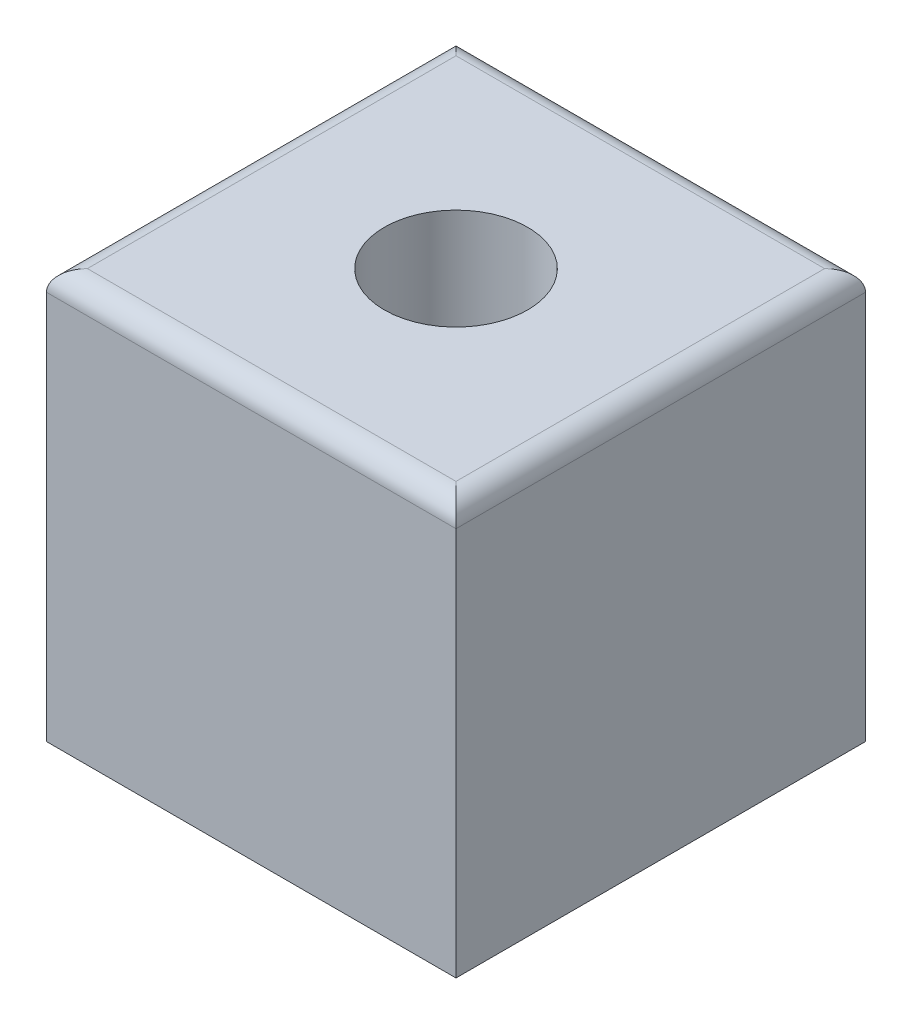
ISO-10303-21;
HEADER;
FILE_DESCRIPTION(('STEP AP214'),'2;1');
FILE_NAME('part.step','',(''),(''),'','','');
FILE_SCHEMA(('AUTOMOTIVE_DESIGN { 1 0 10303 214 1 1 1 1 }'));
ENDSEC;
DATA;
#1=APPLICATION_CONTEXT('core data for automotive mechanical design processes');
#2=APPLICATION_PROTOCOL_DEFINITION('international standard','automotive_design',2000,#1);
#3=PRODUCT_CONTEXT('',#1,'mechanical');
#4=PRODUCT('Part','Part','',(#3));
#5=PRODUCT_RELATED_PRODUCT_CATEGORY('part','',(#4));
#6=PRODUCT_DEFINITION_FORMATION('','',#4);
#7=PRODUCT_DEFINITION_CONTEXT('part definition',#1,'design');
#8=PRODUCT_DEFINITION('design','',#6,#7);
#9=PRODUCT_DEFINITION_SHAPE('','',#8);
#10=(LENGTH_UNIT() NAMED_UNIT(*) SI_UNIT(.MILLI.,.METRE.));
#11=(NAMED_UNIT(*) PLANE_ANGLE_UNIT() SI_UNIT($,.RADIAN.));
#12=(NAMED_UNIT(*) SI_UNIT($,.STERADIAN.) SOLID_ANGLE_UNIT());
#13=UNCERTAINTY_MEASURE_WITH_UNIT(LENGTH_MEASURE(1.E-05),#10,'distance_accuracy_value','');
#14=(GEOMETRIC_REPRESENTATION_CONTEXT(3) GLOBAL_UNCERTAINTY_ASSIGNED_CONTEXT((#13)) GLOBAL_UNIT_ASSIGNED_CONTEXT((#10,
#11,#12)) REPRESENTATION_CONTEXT('',''));
#15=CARTESIAN_POINT('',(0.,0.,0.));
#16=DIRECTION('',(0.,0.,1.));
#17=DIRECTION('',(1.,0.,0.));
#18=AXIS2_PLACEMENT_3D('',#15,#16,#17);
#19=CARTESIAN_POINT('',(-127.,127.,127.));
#20=DIRECTION('',(1.,0.,0.));
#21=DIRECTION('',(0.,1.,0.));
#22=AXIS2_PLACEMENT_3D('',#19,#20,#21);
#23=PLANE('',#22);
#24=DIRECTION('',(0.,-1.,0.));
#25=VECTOR('',#24,1.);
#26=CARTESIAN_POINT('',(-127.,127.,127.));
#27=LINE('',#26,#25);
#28=CARTESIAN_POINT('',(-127.,114.3,127.));
#29=VERTEX_POINT('',#28);
#30=CARTESIAN_POINT('',(-127.,-127.,127.));
#31=VERTEX_POINT('',#30);
#32=EDGE_CURVE('E85',#29,#31,#27,.T.);
#33=ORIENTED_EDGE('',*,*,#32,.F.);
#34=DIRECTION('',(0.,0.,-1.));
#35=VECTOR('',#34,1.);
#36=CARTESIAN_POINT('',(-127.,114.3,-127.));
#37=LINE('',#36,#35);
#38=CARTESIAN_POINT('',(-127.,114.3,-127.));
#39=VERTEX_POINT('',#38);
#40=EDGE_CURVE('E55',#29,#39,#37,.T.);
#41=ORIENTED_EDGE('',*,*,#40,.T.);
#42=DIRECTION('',(0.,-1.,0.));
#43=VECTOR('',#42,1.);
#44=CARTESIAN_POINT('',(-127.,127.,-127.));
#45=LINE('',#44,#43);
#46=CARTESIAN_POINT('',(-127.,-127.,-127.));
#47=VERTEX_POINT('',#46);
#48=EDGE_CURVE('E102',#39,#47,#45,.T.);
#49=ORIENTED_EDGE('',*,*,#48,.T.);
#50=DIRECTION('',(0.,0.,-1.));
#51=VECTOR('',#50,1.);
#52=CARTESIAN_POINT('',(-127.,-127.,127.));
#53=LINE('',#52,#51);
#54=EDGE_CURVE('E97',#31,#47,#53,.T.);
#55=ORIENTED_EDGE('',*,*,#54,.F.);
#56=EDGE_LOOP('',(#33,#41,#49,#55));
#57=FACE_BOUND('',#56,.T.);
#58=ADVANCED_FACE('F33',(#57),#23,.F.);
#59=CARTESIAN_POINT('',(-127.,-127.,127.));
#60=DIRECTION('',(0.,1.,0.));
#61=DIRECTION('',(0.,0.,1.));
#62=AXIS2_PLACEMENT_3D('',#59,#60,#61);
#63=PLANE('',#62);
#64=DIRECTION('',(1.,0.,0.));
#65=VECTOR('',#64,1.);
#66=CARTESIAN_POINT('',(-127.,-127.,-127.));
#67=LINE('',#66,#65);
#68=CARTESIAN_POINT('',(127.,-127.,-127.));
#69=VERTEX_POINT('',#68);
#70=EDGE_CURVE('E146',#47,#69,#67,.T.);
#71=ORIENTED_EDGE('',*,*,#70,.T.);
#72=DIRECTION('',(0.,0.,-1.));
#73=VECTOR('',#72,1.);
#74=CARTESIAN_POINT('',(127.,-127.,127.));
#75=LINE('',#74,#73);
#76=CARTESIAN_POINT('',(127.,-127.,127.));
#77=VERTEX_POINT('',#76);
#78=EDGE_CURVE('E99',#77,#69,#75,.T.);
#79=ORIENTED_EDGE('',*,*,#78,.F.);
#80=DIRECTION('',(1.,0.,0.));
#81=VECTOR('',#80,1.);
#82=CARTESIAN_POINT('',(-127.,-127.,127.));
#83=LINE('',#82,#81);
#84=EDGE_CURVE('E88',#31,#77,#83,.T.);
#85=ORIENTED_EDGE('',*,*,#84,.F.);
#86=ORIENTED_EDGE('',*,*,#54,.T.);
#87=EDGE_LOOP('',(#71,#79,#85,#86));
#88=FACE_BOUND('',#87,.T.);
#89=ADVANCED_FACE('F96',(#88),#63,.F.);
#90=CARTESIAN_POINT('',(127.,127.,127.));
#91=DIRECTION('',(1.,0.,0.));
#92=DIRECTION('',(0.,0.,-1.));
#93=AXIS2_PLACEMENT_3D('',#90,#91,#92);
#94=PLANE('',#93);
#95=DIRECTION('',(0.,-1.,0.));
#96=VECTOR('',#95,1.);
#97=CARTESIAN_POINT('',(127.,127.,-127.));
#98=LINE('',#97,#96);
#99=CARTESIAN_POINT('',(127.,114.3,-127.));
#100=VERTEX_POINT('',#99);
#101=EDGE_CURVE('E91',#100,#69,#98,.T.);
#102=ORIENTED_EDGE('',*,*,#101,.F.);
#103=DIRECTION('',(0.,0.,-1.));
#104=VECTOR('',#103,1.);
#105=CARTESIAN_POINT('',(127.,114.3,127.));
#106=LINE('',#105,#104);
#107=CARTESIAN_POINT('',(127.,114.3,127.));
#108=VERTEX_POINT('',#107);
#109=EDGE_CURVE('E117',#100,#108,#106,.F.);
#110=ORIENTED_EDGE('',*,*,#109,.T.);
#111=DIRECTION('',(0.,-1.,0.));
#112=VECTOR('',#111,1.);
#113=CARTESIAN_POINT('',(127.,127.,127.));
#114=LINE('',#113,#112);
#115=EDGE_CURVE('E100',#108,#77,#114,.T.);
#116=ORIENTED_EDGE('',*,*,#115,.T.);
#117=ORIENTED_EDGE('',*,*,#78,.T.);
#118=EDGE_LOOP('',(#102,#110,#116,#117));
#119=FACE_BOUND('',#118,.T.);
#120=ADVANCED_FACE('F152',(#119),#94,.T.);
#121=CARTESIAN_POINT('',(-127.,127.,127.));
#122=DIRECTION('',(0.,1.,0.));
#123=DIRECTION('',(0.,0.,1.));
#124=AXIS2_PLACEMENT_3D('',#121,#122,#123);
#125=PLANE('',#124);
#126=DIRECTION('',(0.,0.,-1.));
#127=VECTOR('',#126,1.);
#128=CARTESIAN_POINT('',(114.3,127.,127.));
#129=LINE('',#128,#127);
#130=CARTESIAN_POINT('',(114.3,127.,114.3));
#131=VERTEX_POINT('',#130);
#132=CARTESIAN_POINT('',(114.3,127.,-114.3));
#133=VERTEX_POINT('',#132);
#134=EDGE_CURVE('E112',#131,#133,#129,.T.);
#135=ORIENTED_EDGE('',*,*,#134,.T.);
#136=DIRECTION('',(1.,0.,0.));
#137=VECTOR('',#136,1.);
#138=CARTESIAN_POINT('',(-127.,127.,-114.3));
#139=LINE('',#138,#137);
#140=CARTESIAN_POINT('',(-114.3,127.,-114.3));
#141=VERTEX_POINT('',#140);
#142=EDGE_CURVE('E115',#133,#141,#139,.F.);
#143=ORIENTED_EDGE('',*,*,#142,.T.);
#144=DIRECTION('',(0.,0.,-1.));
#145=VECTOR('',#144,1.);
#146=CARTESIAN_POINT('',(-114.3,127.,127.));
#147=LINE('',#146,#145);
#148=CARTESIAN_POINT('',(-114.3,127.,114.3));
#149=VERTEX_POINT('',#148);
#150=EDGE_CURVE('E106',#141,#149,#147,.F.);
#151=ORIENTED_EDGE('',*,*,#150,.T.);
#152=DIRECTION('',(1.,0.,0.));
#153=VECTOR('',#152,1.);
#154=CARTESIAN_POINT('',(-127.,127.,114.3));
#155=LINE('',#154,#153);
#156=EDGE_CURVE('E104',#149,#131,#155,.T.);
#157=ORIENTED_EDGE('',*,*,#156,.T.);
#158=EDGE_LOOP('',(#135,#143,#151,#157));
#159=FACE_BOUND('',#158,.T.);
#160=CARTESIAN_POINT('',(0.,127.,0.));
#161=DIRECTION('',(0.,1.,0.));
#162=DIRECTION('',(0.,0.,1.));
#163=AXIS2_PLACEMENT_3D('',#160,#161,#162);
#164=CIRCLE('',#163,44.45);
#165=CARTESIAN_POINT('',(0.,127.,44.45));
#166=VERTEX_POINT('',#165);
#167=EDGE_CURVE('E132',#166,#166,#164,.T.);
#168=ORIENTED_EDGE('',*,*,#167,.F.);
#169=EDGE_LOOP('',(#168));
#170=FACE_BOUND('',#169,.T.);
#171=ADVANCED_FACE('F161',(#159,#170),#125,.T.);
#172=CARTESIAN_POINT('',(0.,0.,127.));
#173=DIRECTION('',(0.,0.,1.));
#174=DIRECTION('',(1.,0.,0.));
#175=AXIS2_PLACEMENT_3D('',#172,#173,#174);
#176=PLANE('',#175);
#177=ORIENTED_EDGE('',*,*,#115,.F.);
#178=DIRECTION('',(1.,0.,0.));
#179=VECTOR('',#178,1.);
#180=CARTESIAN_POINT('',(0.,114.3,127.));
#181=LINE('',#180,#179);
#182=EDGE_CURVE('E11',#108,#29,#181,.F.);
#183=ORIENTED_EDGE('',*,*,#182,.T.);
#184=ORIENTED_EDGE('',*,*,#32,.T.);
#185=ORIENTED_EDGE('',*,*,#84,.T.);
#186=EDGE_LOOP('',(#177,#183,#184,#185));
#187=FACE_BOUND('',#186,.T.);
#188=ADVANCED_FACE('F87',(#187),#176,.T.);
#189=CARTESIAN_POINT('',(0.,0.,-127.));
#190=DIRECTION('',(0.,0.,1.));
#191=DIRECTION('',(1.,0.,0.));
#192=AXIS2_PLACEMENT_3D('',#189,#190,#191);
#193=PLANE('',#192);
#194=ORIENTED_EDGE('',*,*,#48,.F.);
#195=DIRECTION('',(1.,0.,0.));
#196=VECTOR('',#195,1.);
#197=CARTESIAN_POINT('',(127.,114.3,-127.));
#198=LINE('',#197,#196);
#199=EDGE_CURVE('E42',#39,#100,#198,.T.);
#200=ORIENTED_EDGE('',*,*,#199,.T.);
#201=ORIENTED_EDGE('',*,*,#101,.T.);
#202=ORIENTED_EDGE('',*,*,#70,.F.);
#203=EDGE_LOOP('',(#194,#200,#201,#202));
#204=FACE_BOUND('',#203,.T.);
#205=ADVANCED_FACE('F149',(#204),#193,.F.);
#206=CARTESIAN_POINT('',(0.,44.45,0.));
#207=DIRECTION('',(0.,1.,0.));
#208=DIRECTION('',(0.,0.,1.));
#209=AXIS2_PLACEMENT_3D('',#206,#207,#208);
#210=CYLINDRICAL_SURFACE('',#209,44.45);
#211=CARTESIAN_POINT('',(0.,44.45,0.));
#212=DIRECTION('',(0.,1.,0.));
#213=DIRECTION('',(0.,0.,1.));
#214=AXIS2_PLACEMENT_3D('',#211,#212,#213);
#215=CIRCLE('',#214,44.45);
#216=CARTESIAN_POINT('',(0.,44.45,44.45));
#217=VERTEX_POINT('',#216);
#218=EDGE_CURVE('E137',#217,#217,#215,.T.);
#219=ORIENTED_EDGE('',*,*,#218,.F.);
#220=EDGE_LOOP('',(#219));
#221=FACE_BOUND('',#220,.T.);
#222=ORIENTED_EDGE('',*,*,#167,.T.);
#223=EDGE_LOOP('',(#222));
#224=FACE_BOUND('',#223,.T.);
#225=ADVANCED_FACE('F208',(#221,#224),#210,.F.);
#226=CARTESIAN_POINT('',(0.,44.45,0.));
#227=DIRECTION('',(0.,1.,0.));
#228=DIRECTION('',(0.,0.,1.));
#229=AXIS2_PLACEMENT_3D('',#226,#227,#228);
#230=PLANE('',#229);
#231=ORIENTED_EDGE('',*,*,#218,.T.);
#232=EDGE_LOOP('',(#231));
#233=FACE_BOUND('',#232,.T.);
#234=ADVANCED_FACE('F170',(#233),#230,.T.);
#235=CARTESIAN_POINT('',(-114.3,114.3,127.));
#236=DIRECTION('',(0.,0.,1.));
#237=DIRECTION('',(1.,0.,0.));
#238=AXIS2_PLACEMENT_3D('',#235,#236,#237);
#239=CYLINDRICAL_SURFACE('',#238,12.7);
#240=CARTESIAN_POINT('',(-114.3,114.3,-114.3));
#241=DIRECTION('',(-0.707106781186547,0.,0.707106781186547));
#242=DIRECTION('',(-0.707106781186547,0.,-0.707106781186547));
#243=AXIS2_PLACEMENT_3D('',#240,#241,#242);
#244=ELLIPSE('',#243,17.9605122421383,12.7);
#245=EDGE_CURVE('E125',#39,#141,#244,.F.);
#246=ORIENTED_EDGE('',*,*,#245,.F.);
#247=ORIENTED_EDGE('',*,*,#40,.F.);
#248=CARTESIAN_POINT('',(-114.3,114.3,114.3));
#249=DIRECTION('',(0.707106781186547,0.,0.707106781186547));
#250=DIRECTION('',(0.707106781186547,0.,-0.707106781186547));
#251=AXIS2_PLACEMENT_3D('',#248,#249,#250);
#252=ELLIPSE('',#251,17.9605122421383,12.7);
#253=EDGE_CURVE('E37',#149,#29,#252,.T.);
#254=ORIENTED_EDGE('',*,*,#253,.F.);
#255=ORIENTED_EDGE('',*,*,#150,.F.);
#256=EDGE_LOOP('',(#246,#247,#254,#255));
#257=FACE_BOUND('',#256,.T.);
#258=ADVANCED_FACE('F35',(#257),#239,.T.);
#259=CARTESIAN_POINT('',(-127.,114.3,114.3));
#260=DIRECTION('',(1.,0.,0.));
#261=DIRECTION('',(0.,0.,-1.));
#262=AXIS2_PLACEMENT_3D('',#259,#260,#261);
#263=CYLINDRICAL_SURFACE('',#262,12.7);
#264=ORIENTED_EDGE('',*,*,#253,.T.);
#265=ORIENTED_EDGE('',*,*,#182,.F.);
#266=CARTESIAN_POINT('',(114.3,114.3,114.3));
#267=DIRECTION('',(0.707106781186547,0.,-0.707106781186547));
#268=DIRECTION('',(0.707106781186547,0.,0.707106781186547));
#269=AXIS2_PLACEMENT_3D('',#266,#267,#268);
#270=ELLIPSE('',#269,17.9605122421383,12.7);
#271=EDGE_CURVE('E124',#131,#108,#270,.T.);
#272=ORIENTED_EDGE('',*,*,#271,.F.);
#273=ORIENTED_EDGE('',*,*,#156,.F.);
#274=EDGE_LOOP('',(#264,#265,#272,#273));
#275=FACE_BOUND('',#274,.T.);
#276=ADVANCED_FACE('F163',(#275),#263,.T.);
#277=CARTESIAN_POINT('',(0.,114.3,-114.3));
#278=DIRECTION('',(-1.,0.,0.));
#279=DIRECTION('',(0.,0.,1.));
#280=AXIS2_PLACEMENT_3D('',#277,#278,#279);
#281=CYLINDRICAL_SURFACE('',#280,12.7);
#282=ORIENTED_EDGE('',*,*,#245,.T.);
#283=ORIENTED_EDGE('',*,*,#142,.F.);
#284=CARTESIAN_POINT('',(114.3,114.3,-114.3));
#285=DIRECTION('',(-0.707106781186547,0.,-0.707106781186547));
#286=DIRECTION('',(-0.707106781186547,0.,0.707106781186547));
#287=AXIS2_PLACEMENT_3D('',#284,#285,#286);
#288=ELLIPSE('',#287,17.9605122421383,12.7);
#289=EDGE_CURVE('E122',#100,#133,#288,.F.);
#290=ORIENTED_EDGE('',*,*,#289,.F.);
#291=ORIENTED_EDGE('',*,*,#199,.F.);
#292=EDGE_LOOP('',(#282,#283,#290,#291));
#293=FACE_BOUND('',#292,.T.);
#294=ADVANCED_FACE('F158',(#293),#281,.T.);
#295=CARTESIAN_POINT('',(114.3,114.3,127.));
#296=DIRECTION('',(0.,0.,-1.));
#297=DIRECTION('',(-1.,0.,0.));
#298=AXIS2_PLACEMENT_3D('',#295,#296,#297);
#299=CYLINDRICAL_SURFACE('',#298,12.7);
#300=ORIENTED_EDGE('',*,*,#271,.T.);
#301=ORIENTED_EDGE('',*,*,#109,.F.);
#302=ORIENTED_EDGE('',*,*,#289,.T.);
#303=ORIENTED_EDGE('',*,*,#134,.F.);
#304=EDGE_LOOP('',(#300,#301,#302,#303));
#305=FACE_BOUND('',#304,.T.);
#306=ADVANCED_FACE('F155',(#305),#299,.T.);
#307=CLOSED_SHELL('',(#58,#89,#120,#171,#188,#205,#225,#234,#258,#276,#294,#306));
#308=MANIFOLD_SOLID_BREP('B2',#307);
#309=ADVANCED_BREP_SHAPE_REPRESENTATION('',(#18,#308),#14);
#310=SHAPE_DEFINITION_REPRESENTATION(#9,#309);
ENDSEC;
END-ISO-10303-21;
